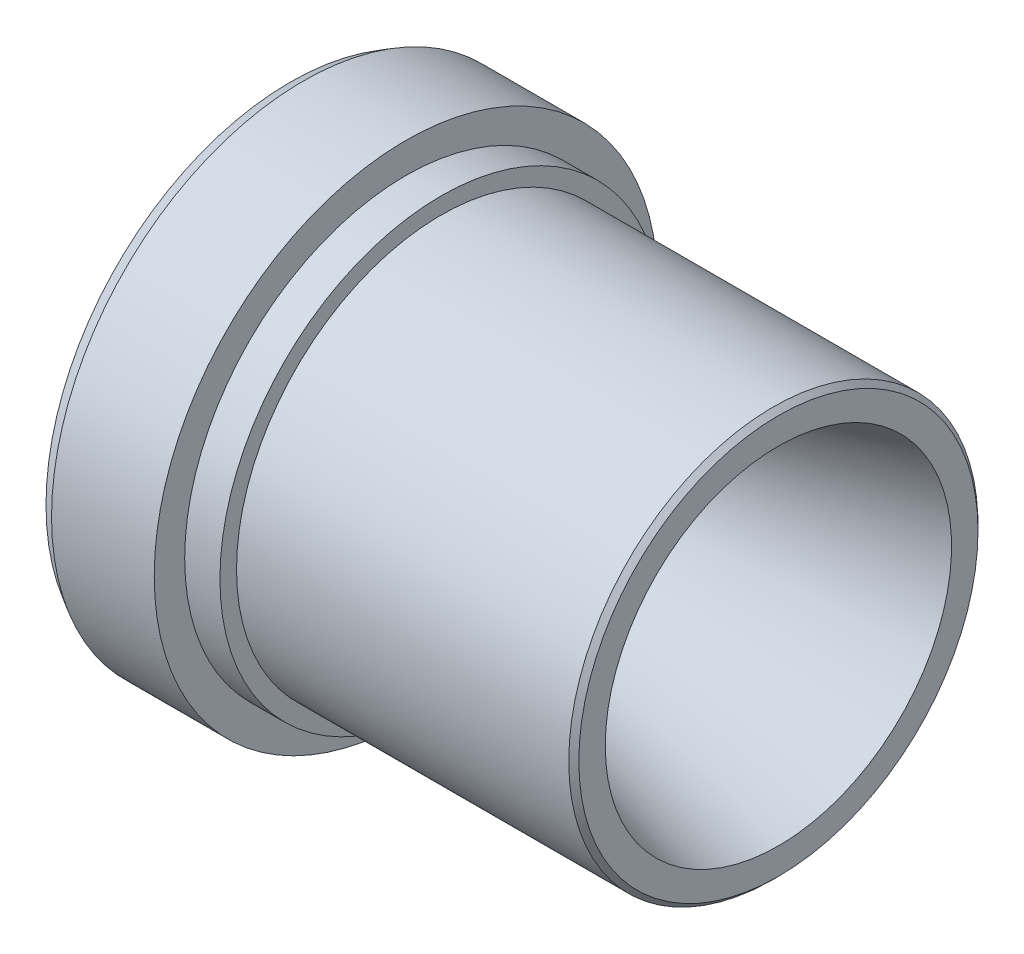
ISO-10303-21;
HEADER;
FILE_DESCRIPTION(('STEP AP214'),'2;1');
FILE_NAME('part.step','',(''),(''),'','','');
FILE_SCHEMA(('AUTOMOTIVE_DESIGN { 1 0 10303 214 1 1 1 1 }'));
ENDSEC;
DATA;
#1=APPLICATION_CONTEXT('core data for automotive mechanical design processes');
#2=APPLICATION_PROTOCOL_DEFINITION('international standard','automotive_design',2000,#1);
#3=PRODUCT_CONTEXT('',#1,'mechanical');
#4=PRODUCT('Part','Part','',(#3));
#5=PRODUCT_RELATED_PRODUCT_CATEGORY('part','',(#4));
#6=PRODUCT_DEFINITION_FORMATION('','',#4);
#7=PRODUCT_DEFINITION_CONTEXT('part definition',#1,'design');
#8=PRODUCT_DEFINITION('design','',#6,#7);
#9=PRODUCT_DEFINITION_SHAPE('','',#8);
#10=(LENGTH_UNIT() NAMED_UNIT(*) SI_UNIT(.MILLI.,.METRE.));
#11=(NAMED_UNIT(*) PLANE_ANGLE_UNIT() SI_UNIT($,.RADIAN.));
#12=(NAMED_UNIT(*) SI_UNIT($,.STERADIAN.) SOLID_ANGLE_UNIT());
#13=UNCERTAINTY_MEASURE_WITH_UNIT(LENGTH_MEASURE(1.E-05),#10,'distance_accuracy_value','');
#14=(GEOMETRIC_REPRESENTATION_CONTEXT(3) GLOBAL_UNCERTAINTY_ASSIGNED_CONTEXT((#13)) GLOBAL_UNIT_ASSIGNED_CONTEXT((#10,
#11,#12)) REPRESENTATION_CONTEXT('',''));
#15=CARTESIAN_POINT('',(0.,0.,0.));
#16=DIRECTION('',(0.,0.,1.));
#17=DIRECTION('',(1.,0.,0.));
#18=AXIS2_PLACEMENT_3D('',#15,#16,#17);
#19=CARTESIAN_POINT('',(0.,0.,0.));
#20=DIRECTION('',(-1.,0.,0.));
#21=DIRECTION('',(0.,0.,1.));
#22=AXIS2_PLACEMENT_3D('',#19,#20,#21);
#23=CONICAL_SURFACE('',#22,7.9375,0.785398163397448);
#24=CARTESIAN_POINT('',(4.2418,0.,0.));
#25=DIRECTION('',(-1.,0.,0.));
#26=DIRECTION('',(0.,0.,1.));
#27=AXIS2_PLACEMENT_3D('',#24,#25,#26);
#28=CIRCLE('',#27,3.6957);
#29=CARTESIAN_POINT('',(4.2418,0.,3.6957));
#30=VERTEX_POINT('',#29);
#31=EDGE_CURVE('E92',#30,#30,#28,.T.);
#32=ORIENTED_EDGE('',*,*,#31,.F.);
#33=EDGE_LOOP('',(#32));
#34=FACE_BOUND('',#33,.T.);
#35=CARTESIAN_POINT('',(0.,0.,0.));
#36=DIRECTION('',(-1.,0.,0.));
#37=DIRECTION('',(0.,0.,1.));
#38=AXIS2_PLACEMENT_3D('',#35,#36,#37);
#39=CIRCLE('',#38,7.9375);
#40=CARTESIAN_POINT('',(0.,0.,7.9375));
#41=VERTEX_POINT('',#40);
#42=EDGE_CURVE('E10',#41,#41,#39,.T.);
#43=ORIENTED_EDGE('',*,*,#42,.T.);
#44=EDGE_LOOP('',(#43));
#45=FACE_BOUND('',#44,.T.);
#46=ADVANCED_FACE('F41',(#34,#45),#23,.F.);
#47=CARTESIAN_POINT('',(0.,7.9375,0.));
#48=DIRECTION('',(1.,0.,0.));
#49=DIRECTION('',(0.,0.,-1.));
#50=AXIS2_PLACEMENT_3D('',#47,#48,#49);
#51=PLANE('',#50);
#52=ORIENTED_EDGE('',*,*,#42,.F.);
#53=EDGE_LOOP('',(#52));
#54=FACE_BOUND('',#53,.T.);
#55=CARTESIAN_POINT('',(0.,0.,0.));
#56=DIRECTION('',(-1.,0.,0.));
#57=DIRECTION('',(0.,0.,1.));
#58=AXIS2_PLACEMENT_3D('',#55,#56,#57);
#59=CIRCLE('',#58,12.319);
#60=CARTESIAN_POINT('',(0.,0.,12.319));
#61=VERTEX_POINT('',#60);
#62=EDGE_CURVE('E48',#61,#61,#59,.T.);
#63=ORIENTED_EDGE('',*,*,#62,.T.);
#64=EDGE_LOOP('',(#63));
#65=FACE_BOUND('',#64,.T.);
#66=ADVANCED_FACE('F100',(#54,#65),#51,.F.);
#67=CARTESIAN_POINT('',(0.659911357683742,0.,0.));
#68=DIRECTION('',(1.,0.,0.));
#69=DIRECTION('',(0.,0.,-1.));
#70=AXIS2_PLACEMENT_3D('',#67,#68,#69);
#71=CONICAL_SURFACE('',#70,12.7,0.523598775598298);
#72=ORIENTED_EDGE('',*,*,#62,.F.);
#73=EDGE_LOOP('',(#72));
#74=FACE_BOUND('',#73,.T.);
#75=CARTESIAN_POINT('',(0.659911357683742,0.,0.));
#76=DIRECTION('',(-1.,0.,0.));
#77=DIRECTION('',(0.,0.,1.));
#78=AXIS2_PLACEMENT_3D('',#75,#76,#77);
#79=CIRCLE('',#78,12.7);
#80=CARTESIAN_POINT('',(0.659911357683742,0.,12.7));
#81=VERTEX_POINT('',#80);
#82=EDGE_CURVE('E53',#81,#81,#79,.T.);
#83=ORIENTED_EDGE('',*,*,#82,.T.);
#84=EDGE_LOOP('',(#83));
#85=FACE_BOUND('',#84,.T.);
#86=ADVANCED_FACE('F104',(#74,#85),#71,.T.);
#87=CARTESIAN_POINT('',(0.,0.,0.));
#88=DIRECTION('',(-1.,0.,0.));
#89=DIRECTION('',(0.,0.,1.));
#90=AXIS2_PLACEMENT_3D('',#87,#88,#89);
#91=CYLINDRICAL_SURFACE('',#90,12.7);
#92=ORIENTED_EDGE('',*,*,#82,.F.);
#93=EDGE_LOOP('',(#92));
#94=FACE_BOUND('',#93,.T.);
#95=CARTESIAN_POINT('',(5.842,0.,0.));
#96=DIRECTION('',(-1.,0.,0.));
#97=DIRECTION('',(0.,0.,1.));
#98=AXIS2_PLACEMENT_3D('',#95,#96,#97);
#99=CIRCLE('',#98,12.7);
#100=CARTESIAN_POINT('',(5.842,0.,12.7));
#101=VERTEX_POINT('',#100);
#102=EDGE_CURVE('E58',#101,#101,#99,.T.);
#103=ORIENTED_EDGE('',*,*,#102,.T.);
#104=EDGE_LOOP('',(#103));
#105=FACE_BOUND('',#104,.T.);
#106=ADVANCED_FACE('F109',(#94,#105),#91,.T.);
#107=CARTESIAN_POINT('',(5.842,12.7,0.));
#108=DIRECTION('',(-1.,0.,0.));
#109=DIRECTION('',(0.,0.,1.));
#110=AXIS2_PLACEMENT_3D('',#107,#108,#109);
#111=PLANE('',#110);
#112=ORIENTED_EDGE('',*,*,#102,.F.);
#113=EDGE_LOOP('',(#112));
#114=FACE_BOUND('',#113,.T.);
#115=CARTESIAN_POINT('',(5.842,0.,0.));
#116=DIRECTION('',(-1.,0.,0.));
#117=DIRECTION('',(0.,0.,1.));
#118=AXIS2_PLACEMENT_3D('',#115,#116,#117);
#119=CIRCLE('',#118,11.1633);
#120=CARTESIAN_POINT('',(5.842,0.,11.1633));
#121=VERTEX_POINT('',#120);
#122=EDGE_CURVE('E64',#121,#121,#119,.T.);
#123=ORIENTED_EDGE('',*,*,#122,.T.);
#124=EDGE_LOOP('',(#123));
#125=FACE_BOUND('',#124,.T.);
#126=ADVANCED_FACE('F115',(#114,#125),#111,.F.);
#127=CARTESIAN_POINT('',(0.,0.,0.));
#128=DIRECTION('',(-1.,0.,0.));
#129=DIRECTION('',(0.,0.,1.));
#130=AXIS2_PLACEMENT_3D('',#127,#128,#129);
#131=CYLINDRICAL_SURFACE('',#130,11.1633);
#132=ORIENTED_EDGE('',*,*,#122,.F.);
#133=EDGE_LOOP('',(#132));
#134=FACE_BOUND('',#133,.T.);
#135=CARTESIAN_POINT('',(7.62,0.,0.));
#136=DIRECTION('',(-1.,0.,0.));
#137=DIRECTION('',(0.,0.,1.));
#138=AXIS2_PLACEMENT_3D('',#135,#136,#137);
#139=CIRCLE('',#138,11.1633);
#140=CARTESIAN_POINT('',(7.62,0.,11.1633));
#141=VERTEX_POINT('',#140);
#142=EDGE_CURVE('E68',#141,#141,#139,.T.);
#143=ORIENTED_EDGE('',*,*,#142,.T.);
#144=EDGE_LOOP('',(#143));
#145=FACE_BOUND('',#144,.T.);
#146=ADVANCED_FACE('F119',(#134,#145),#131,.T.);
#147=CARTESIAN_POINT('',(7.62,11.1633,0.));
#148=DIRECTION('',(-1.,0.,0.));
#149=DIRECTION('',(0.,0.,1.));
#150=AXIS2_PLACEMENT_3D('',#147,#148,#149);
#151=PLANE('',#150);
#152=ORIENTED_EDGE('',*,*,#142,.F.);
#153=EDGE_LOOP('',(#152));
#154=FACE_BOUND('',#153,.T.);
#155=CARTESIAN_POINT('',(7.62,0.,0.));
#156=DIRECTION('',(-1.,0.,0.));
#157=DIRECTION('',(0.,0.,1.));
#158=AXIS2_PLACEMENT_3D('',#155,#156,#157);
#159=CIRCLE('',#158,10.3251);
#160=CARTESIAN_POINT('',(7.62,0.,10.3251));
#161=VERTEX_POINT('',#160);
#162=EDGE_CURVE('E72',#161,#161,#159,.T.);
#163=ORIENTED_EDGE('',*,*,#162,.T.);
#164=EDGE_LOOP('',(#163));
#165=FACE_BOUND('',#164,.T.);
#166=ADVANCED_FACE('F123',(#154,#165),#151,.F.);
#167=CARTESIAN_POINT('',(0.,0.,0.));
#168=DIRECTION('',(-1.,0.,0.));
#169=DIRECTION('',(0.,0.,1.));
#170=AXIS2_PLACEMENT_3D('',#167,#168,#169);
#171=CYLINDRICAL_SURFACE('',#170,10.3251);
#172=ORIENTED_EDGE('',*,*,#162,.F.);
#173=EDGE_LOOP('',(#172));
#174=FACE_BOUND('',#173,.T.);
#175=CARTESIAN_POINT('',(24.384,0.,0.));
#176=DIRECTION('',(-1.,0.,0.));
#177=DIRECTION('',(0.,0.,1.));
#178=AXIS2_PLACEMENT_3D('',#175,#176,#177);
#179=CIRCLE('',#178,10.3251);
#180=CARTESIAN_POINT('',(24.384,0.,10.3251));
#181=VERTEX_POINT('',#180);
#182=EDGE_CURVE('E76',#181,#181,#179,.T.);
#183=ORIENTED_EDGE('',*,*,#182,.T.);
#184=EDGE_LOOP('',(#183));
#185=FACE_BOUND('',#184,.T.);
#186=ADVANCED_FACE('F127',(#174,#185),#171,.T.);
#187=CARTESIAN_POINT('',(24.638,0.,0.));
#188=DIRECTION('',(-1.,0.,0.));
#189=DIRECTION('',(0.,0.,1.));
#190=AXIS2_PLACEMENT_3D('',#187,#188,#189);
#191=CONICAL_SURFACE('',#190,10.0711,0.785398163397445);
#192=ORIENTED_EDGE('',*,*,#182,.F.);
#193=EDGE_LOOP('',(#192));
#194=FACE_BOUND('',#193,.T.);
#195=CARTESIAN_POINT('',(24.638,0.,0.));
#196=DIRECTION('',(-1.,0.,0.));
#197=DIRECTION('',(0.,0.,1.));
#198=AXIS2_PLACEMENT_3D('',#195,#196,#197);
#199=CIRCLE('',#198,10.0711);
#200=CARTESIAN_POINT('',(24.638,0.,10.0711));
#201=VERTEX_POINT('',#200);
#202=EDGE_CURVE('E80',#201,#201,#199,.T.);
#203=ORIENTED_EDGE('',*,*,#202,.T.);
#204=EDGE_LOOP('',(#203));
#205=FACE_BOUND('',#204,.T.);
#206=ADVANCED_FACE('F131',(#194,#205),#191,.T.);
#207=CARTESIAN_POINT('',(24.638,10.0711,0.));
#208=DIRECTION('',(-1.,0.,0.));
#209=DIRECTION('',(0.,0.,1.));
#210=AXIS2_PLACEMENT_3D('',#207,#208,#209);
#211=PLANE('',#210);
#212=ORIENTED_EDGE('',*,*,#202,.F.);
#213=EDGE_LOOP('',(#212));
#214=FACE_BOUND('',#213,.T.);
#215=CARTESIAN_POINT('',(24.638,0.,0.));
#216=DIRECTION('',(-1.,0.,0.));
#217=DIRECTION('',(0.,0.,1.));
#218=AXIS2_PLACEMENT_3D('',#215,#216,#217);
#219=CIRCLE('',#218,8.7376);
#220=CARTESIAN_POINT('',(24.638,0.,8.7376));
#221=VERTEX_POINT('',#220);
#222=EDGE_CURVE('E84',#221,#221,#219,.T.);
#223=ORIENTED_EDGE('',*,*,#222,.T.);
#224=EDGE_LOOP('',(#223));
#225=FACE_BOUND('',#224,.T.);
#226=ADVANCED_FACE('F135',(#214,#225),#211,.F.);
#227=CARTESIAN_POINT('',(5.842,0.,0.));
#228=DIRECTION('',(1.,0.,0.));
#229=DIRECTION('',(0.,0.,-1.));
#230=AXIS2_PLACEMENT_3D('',#227,#228,#229);
#231=CONICAL_SURFACE('',#230,3.6957,0.262073720768019);
#232=ORIENTED_EDGE('',*,*,#222,.F.);
#233=EDGE_LOOP('',(#232));
#234=FACE_BOUND('',#233,.T.);
#235=CARTESIAN_POINT('',(5.842,0.,0.));
#236=DIRECTION('',(-1.,0.,0.));
#237=DIRECTION('',(0.,0.,1.));
#238=AXIS2_PLACEMENT_3D('',#235,#236,#237);
#239=CIRCLE('',#238,3.6957);
#240=CARTESIAN_POINT('',(5.842,0.,3.6957));
#241=VERTEX_POINT('',#240);
#242=EDGE_CURVE('E88',#241,#241,#239,.T.);
#243=ORIENTED_EDGE('',*,*,#242,.T.);
#244=EDGE_LOOP('',(#243));
#245=FACE_BOUND('',#244,.T.);
#246=ADVANCED_FACE('F139',(#234,#245),#231,.F.);
#247=CARTESIAN_POINT('',(0.,0.,0.));
#248=DIRECTION('',(-1.,0.,0.));
#249=DIRECTION('',(0.,0.,1.));
#250=AXIS2_PLACEMENT_3D('',#247,#248,#249);
#251=CYLINDRICAL_SURFACE('',#250,3.6957);
#252=ORIENTED_EDGE('',*,*,#242,.F.);
#253=EDGE_LOOP('',(#252));
#254=FACE_BOUND('',#253,.T.);
#255=ORIENTED_EDGE('',*,*,#31,.T.);
#256=EDGE_LOOP('',(#255));
#257=FACE_BOUND('',#256,.T.);
#258=ADVANCED_FACE('F97',(#254,#257),#251,.F.);
#259=CLOSED_SHELL('',(#46,#66,#86,#106,#126,#146,#166,#186,#206,#226,#246,#258));
#260=MANIFOLD_SOLID_BREP('B2',#259);
#261=ADVANCED_BREP_SHAPE_REPRESENTATION('',(#18,#260),#14);
#262=SHAPE_DEFINITION_REPRESENTATION(#9,#261);
ENDSEC;
END-ISO-10303-21;
